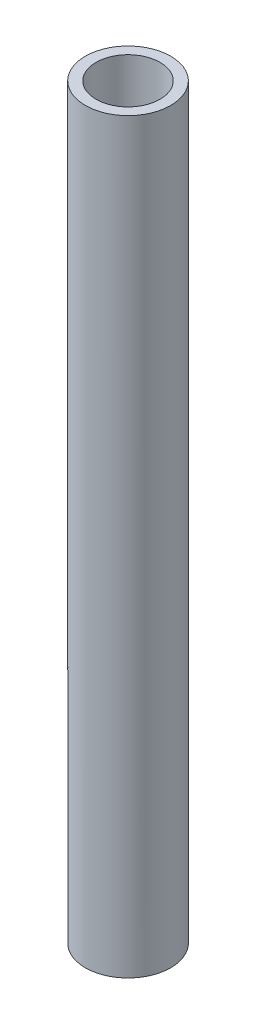
ISO-10303-21;
HEADER;
FILE_DESCRIPTION(('STEP AP214'),'2;1');
FILE_NAME('part.step','',(''),(''),'','','');
FILE_SCHEMA(('AUTOMOTIVE_DESIGN { 1 0 10303 214 1 1 1 1 }'));
ENDSEC;
DATA;
#1=APPLICATION_CONTEXT('core data for automotive mechanical design processes');
#2=APPLICATION_PROTOCOL_DEFINITION('international standard','automotive_design',2000,#1);
#3=PRODUCT_CONTEXT('',#1,'mechanical');
#4=PRODUCT('Part','Part','',(#3));
#5=PRODUCT_RELATED_PRODUCT_CATEGORY('part','',(#4));
#6=PRODUCT_DEFINITION_FORMATION('','',#4);
#7=PRODUCT_DEFINITION_CONTEXT('part definition',#1,'design');
#8=PRODUCT_DEFINITION('design','',#6,#7);
#9=PRODUCT_DEFINITION_SHAPE('','',#8);
#10=(LENGTH_UNIT() NAMED_UNIT(*) SI_UNIT(.MILLI.,.METRE.));
#11=(NAMED_UNIT(*) PLANE_ANGLE_UNIT() SI_UNIT($,.RADIAN.));
#12=(NAMED_UNIT(*) SI_UNIT($,.STERADIAN.) SOLID_ANGLE_UNIT());
#13=UNCERTAINTY_MEASURE_WITH_UNIT(LENGTH_MEASURE(1.E-05),#10,'distance_accuracy_value','');
#14=(GEOMETRIC_REPRESENTATION_CONTEXT(3) GLOBAL_UNCERTAINTY_ASSIGNED_CONTEXT((#13)) GLOBAL_UNIT_ASSIGNED_CONTEXT((#10,
#11,#12)) REPRESENTATION_CONTEXT('',''));
#15=CARTESIAN_POINT('',(0.,0.,0.));
#16=DIRECTION('',(0.,0.,1.));
#17=DIRECTION('',(1.,0.,0.));
#18=AXIS2_PLACEMENT_3D('',#15,#16,#17);
#19=CARTESIAN_POINT('',(0.,0.,0.));
#20=DIRECTION('',(0.,1.,0.));
#21=DIRECTION('',(0.,0.,1.));
#22=AXIS2_PLACEMENT_3D('',#19,#20,#21);
#23=PLANE('',#22);
#24=CARTESIAN_POINT('',(0.,0.,0.));
#25=DIRECTION('',(0.,1.,0.));
#26=DIRECTION('',(0.,0.,1.));
#27=AXIS2_PLACEMENT_3D('',#24,#25,#26);
#28=CIRCLE('',#27,12.7);
#29=CARTESIAN_POINT('',(0.,0.,12.7));
#30=VERTEX_POINT('',#29);
#31=EDGE_CURVE('E41',#30,#30,#28,.T.);
#32=ORIENTED_EDGE('',*,*,#31,.F.);
#33=EDGE_LOOP('',(#32));
#34=FACE_BOUND('',#33,.T.);
#35=CARTESIAN_POINT('',(0.,0.,0.));
#36=DIRECTION('',(0.,1.,0.));
#37=DIRECTION('',(0.,0.,1.));
#38=AXIS2_PLACEMENT_3D('',#35,#36,#37);
#39=CIRCLE('',#38,9.525);
#40=CARTESIAN_POINT('',(0.,0.,9.525));
#41=VERTEX_POINT('',#40);
#42=EDGE_CURVE('E50',#41,#41,#39,.T.);
#43=ORIENTED_EDGE('',*,*,#42,.T.);
#44=EDGE_LOOP('',(#43));
#45=FACE_BOUND('',#44,.T.);
#46=ADVANCED_FACE('F34',(#34,#45),#23,.F.);
#47=CARTESIAN_POINT('',(0.,258.171024484277,0.));
#48=DIRECTION('',(0.,-1.,0.));
#49=DIRECTION('',(0.,0.,-1.));
#50=AXIS2_PLACEMENT_3D('',#47,#48,#49);
#51=CYLINDRICAL_SURFACE('',#50,12.7);
#52=CARTESIAN_POINT('',(0.,222.25,0.));
#53=DIRECTION('',(0.,-1.,0.));
#54=DIRECTION('',(0.,0.,-1.));
#55=AXIS2_PLACEMENT_3D('',#52,#53,#54);
#56=CIRCLE('',#55,12.7);
#57=CARTESIAN_POINT('',(0.,222.25,-12.7));
#58=VERTEX_POINT('',#57);
#59=EDGE_CURVE('E45',#58,#58,#56,.T.);
#60=ORIENTED_EDGE('',*,*,#59,.T.);
#61=EDGE_LOOP('',(#60));
#62=FACE_BOUND('',#61,.T.);
#63=ORIENTED_EDGE('',*,*,#31,.T.);
#64=EDGE_LOOP('',(#63));
#65=FACE_BOUND('',#64,.T.);
#66=ADVANCED_FACE('F58',(#62,#65),#51,.T.);
#67=CARTESIAN_POINT('',(0.,258.171024484277,0.));
#68=DIRECTION('',(0.,-1.,0.));
#69=DIRECTION('',(0.,0.,-1.));
#70=AXIS2_PLACEMENT_3D('',#67,#68,#69);
#71=CYLINDRICAL_SURFACE('',#70,9.525);
#72=CARTESIAN_POINT('',(0.,222.25,0.));
#73=DIRECTION('',(0.,-1.,0.));
#74=DIRECTION('',(0.,0.,-1.));
#75=AXIS2_PLACEMENT_3D('',#72,#73,#74);
#76=CIRCLE('',#75,9.525);
#77=CARTESIAN_POINT('',(0.,222.25,-9.525));
#78=VERTEX_POINT('',#77);
#79=EDGE_CURVE('E10',#78,#78,#76,.T.);
#80=ORIENTED_EDGE('',*,*,#79,.F.);
#81=EDGE_LOOP('',(#80));
#82=FACE_BOUND('',#81,.T.);
#83=ORIENTED_EDGE('',*,*,#42,.F.);
#84=EDGE_LOOP('',(#83));
#85=FACE_BOUND('',#84,.T.);
#86=ADVANCED_FACE('F56',(#82,#85),#71,.F.);
#87=CARTESIAN_POINT('',(-17.3752747252747,222.25,0.));
#88=DIRECTION('',(0.,-1.,0.));
#89=DIRECTION('',(0.,0.,1.));
#90=AXIS2_PLACEMENT_3D('',#87,#88,#89);
#91=PLANE('',#90);
#92=ORIENTED_EDGE('',*,*,#79,.T.);
#93=EDGE_LOOP('',(#92));
#94=FACE_BOUND('',#93,.T.);
#95=ORIENTED_EDGE('',*,*,#59,.F.);
#96=EDGE_LOOP('',(#95));
#97=FACE_BOUND('',#96,.T.);
#98=ADVANCED_FACE('F36',(#94,#97),#91,.F.);
#99=CLOSED_SHELL('',(#46,#66,#86,#98));
#100=MANIFOLD_SOLID_BREP('B2',#99);
#101=ADVANCED_BREP_SHAPE_REPRESENTATION('',(#18,#100),#14);
#102=SHAPE_DEFINITION_REPRESENTATION(#9,#101);
ENDSEC;
END-ISO-10303-21;
